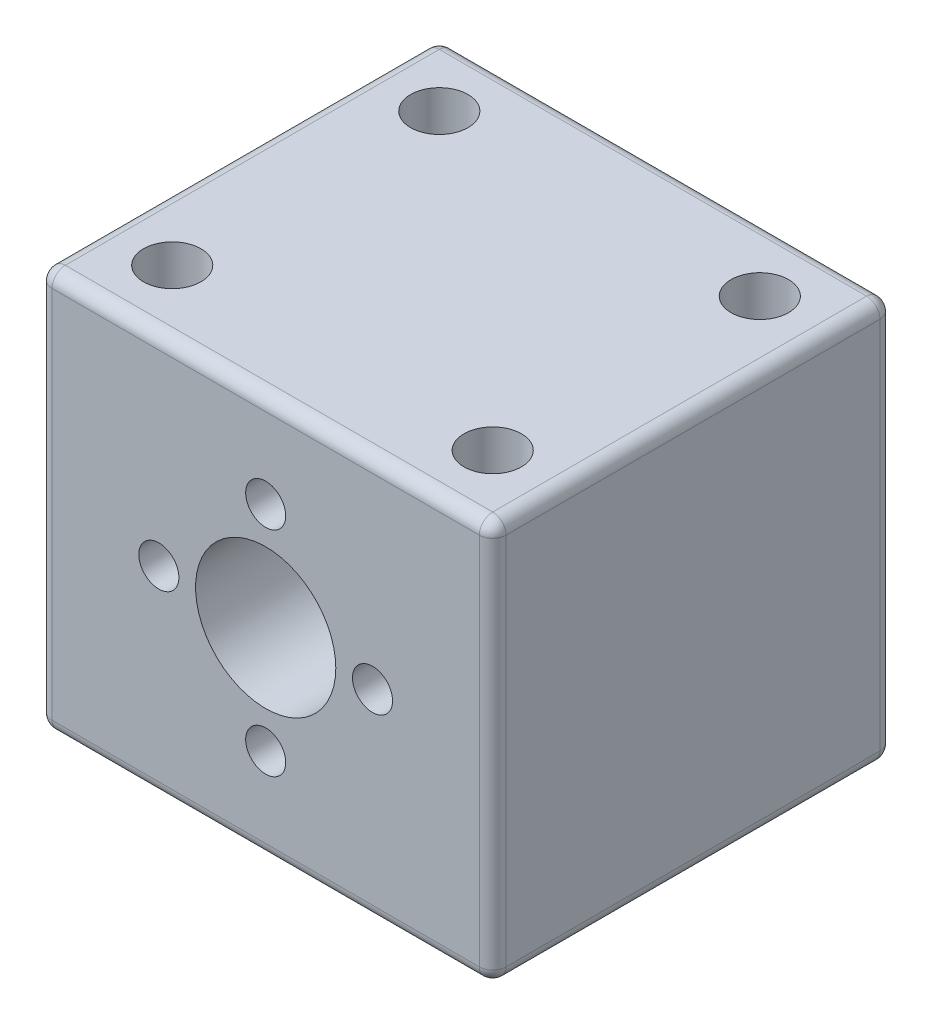
ISO-10303-21;
HEADER;
FILE_DESCRIPTION(('STEP AP214'),'2;1');
FILE_NAME('part.step','',(''),(''),'','','');
FILE_SCHEMA(('AUTOMOTIVE_DESIGN { 1 0 10303 214 1 1 1 1 }'));
ENDSEC;
DATA;
#1=APPLICATION_CONTEXT('core data for automotive mechanical design processes');
#2=APPLICATION_PROTOCOL_DEFINITION('international standard','automotive_design',2000,#1);
#3=PRODUCT_CONTEXT('',#1,'mechanical');
#4=PRODUCT('Part','Part','',(#3));
#5=PRODUCT_RELATED_PRODUCT_CATEGORY('part','',(#4));
#6=PRODUCT_DEFINITION_FORMATION('','',#4);
#7=PRODUCT_DEFINITION_CONTEXT('part definition',#1,'design');
#8=PRODUCT_DEFINITION('design','',#6,#7);
#9=PRODUCT_DEFINITION_SHAPE('','',#8);
#10=(LENGTH_UNIT() NAMED_UNIT(*) SI_UNIT(.MILLI.,.METRE.));
#11=(NAMED_UNIT(*) PLANE_ANGLE_UNIT() SI_UNIT($,.RADIAN.));
#12=(NAMED_UNIT(*) SI_UNIT($,.STERADIAN.) SOLID_ANGLE_UNIT());
#13=UNCERTAINTY_MEASURE_WITH_UNIT(LENGTH_MEASURE(1.E-05),#10,'distance_accuracy_value','');
#14=(GEOMETRIC_REPRESENTATION_CONTEXT(3) GLOBAL_UNCERTAINTY_ASSIGNED_CONTEXT((#13)) GLOBAL_UNIT_ASSIGNED_CONTEXT((#10,
#11,#12)) REPRESENTATION_CONTEXT('',''));
#15=CARTESIAN_POINT('',(0.,0.,0.));
#16=DIRECTION('',(0.,0.,1.));
#17=DIRECTION('',(1.,0.,0.));
#18=AXIS2_PLACEMENT_3D('',#15,#16,#17);
#19=CARTESIAN_POINT('',(0.,0.,30.));
#20=DIRECTION('',(1.,0.,0.));
#21=DIRECTION('',(0.,0.,-1.));
#22=AXIS2_PLACEMENT_3D('',#19,#20,#21);
#23=PLANE('',#22);
#24=DIRECTION('',(0.,-1.,0.));
#25=VECTOR('',#24,1.);
#26=CARTESIAN_POINT('',(0.,0.,1.));
#27=LINE('',#26,#25);
#28=CARTESIAN_POINT('',(0.,-1.,1.));
#29=VERTEX_POINT('',#28);
#30=CARTESIAN_POINT('',(0.,-29.,1.));
#31=VERTEX_POINT('',#30);
#32=EDGE_CURVE('E134',#29,#31,#27,.T.);
#33=ORIENTED_EDGE('',*,*,#32,.T.);
#34=DIRECTION('',(0.,0.,-1.));
#35=VECTOR('',#34,1.);
#36=CARTESIAN_POINT('',(0.,-29.,30.));
#37=LINE('',#36,#35);
#38=CARTESIAN_POINT('',(0.,-29.,29.));
#39=VERTEX_POINT('',#38);
#40=EDGE_CURVE('E132',#31,#39,#37,.F.);
#41=ORIENTED_EDGE('',*,*,#40,.T.);
#42=DIRECTION('',(0.,-1.,0.));
#43=VECTOR('',#42,1.);
#44=CARTESIAN_POINT('',(0.,0.,29.));
#45=LINE('',#44,#43);
#46=CARTESIAN_POINT('',(0.,-1.,29.));
#47=VERTEX_POINT('',#46);
#48=EDGE_CURVE('E125',#39,#47,#45,.F.);
#49=ORIENTED_EDGE('',*,*,#48,.T.);
#50=DIRECTION('',(0.,0.,-1.));
#51=VECTOR('',#50,1.);
#52=CARTESIAN_POINT('',(0.,-1.,30.));
#53=LINE('',#52,#51);
#54=EDGE_CURVE('E129',#47,#29,#53,.T.);
#55=ORIENTED_EDGE('',*,*,#54,.T.);
#56=EDGE_LOOP('',(#33,#41,#49,#55));
#57=FACE_BOUND('',#56,.T.);
#58=ADVANCED_FACE('F34',(#57),#23,.F.);
#59=CARTESIAN_POINT('',(0.,-30.,30.));
#60=DIRECTION('',(0.,1.,0.));
#61=DIRECTION('',(0.,0.,1.));
#62=AXIS2_PLACEMENT_3D('',#59,#60,#61);
#63=PLANE('',#62);
#64=DIRECTION('',(1.,0.,0.));
#65=VECTOR('',#64,1.);
#66=CARTESIAN_POINT('',(0.,-30.,1.));
#67=LINE('',#66,#65);
#68=CARTESIAN_POINT('',(1.,-30.,1.));
#69=VERTEX_POINT('',#68);
#70=CARTESIAN_POINT('',(33.,-30.,1.));
#71=VERTEX_POINT('',#70);
#72=EDGE_CURVE('E180',#69,#71,#67,.T.);
#73=ORIENTED_EDGE('',*,*,#72,.T.);
#74=DIRECTION('',(0.,0.,-1.));
#75=VECTOR('',#74,1.);
#76=CARTESIAN_POINT('',(33.,-30.,30.));
#77=LINE('',#76,#75);
#78=CARTESIAN_POINT('',(33.,-30.,29.));
#79=VERTEX_POINT('',#78);
#80=EDGE_CURVE('E183',#71,#79,#77,.F.);
#81=ORIENTED_EDGE('',*,*,#80,.T.);
#82=DIRECTION('',(1.,0.,0.));
#83=VECTOR('',#82,1.);
#84=CARTESIAN_POINT('',(0.,-30.,29.));
#85=LINE('',#84,#83);
#86=CARTESIAN_POINT('',(1.,-30.,29.));
#87=VERTEX_POINT('',#86);
#88=EDGE_CURVE('E178',#79,#87,#85,.F.);
#89=ORIENTED_EDGE('',*,*,#88,.T.);
#90=DIRECTION('',(0.,0.,-1.));
#91=VECTOR('',#90,1.);
#92=CARTESIAN_POINT('',(1.,-30.,30.));
#93=LINE('',#92,#91);
#94=EDGE_CURVE('E176',#87,#69,#93,.T.);
#95=ORIENTED_EDGE('',*,*,#94,.T.);
#96=EDGE_LOOP('',(#73,#81,#89,#95));
#97=FACE_BOUND('',#96,.T.);
#98=ADVANCED_FACE('F364',(#97),#63,.F.);
#99=CARTESIAN_POINT('',(34.,0.,30.));
#100=DIRECTION('',(-1.,0.,0.));
#101=DIRECTION('',(0.,-1.,0.));
#102=AXIS2_PLACEMENT_3D('',#99,#100,#101);
#103=PLANE('',#102);
#104=DIRECTION('',(0.,1.,0.));
#105=VECTOR('',#104,1.);
#106=CARTESIAN_POINT('',(34.,0.,1.));
#107=LINE('',#106,#105);
#108=CARTESIAN_POINT('',(34.,-29.,1.));
#109=VERTEX_POINT('',#108);
#110=CARTESIAN_POINT('',(34.,-1.,1.));
#111=VERTEX_POINT('',#110);
#112=EDGE_CURVE('E189',#109,#111,#107,.T.);
#113=ORIENTED_EDGE('',*,*,#112,.T.);
#114=DIRECTION('',(0.,0.,-1.));
#115=VECTOR('',#114,1.);
#116=CARTESIAN_POINT('',(34.,-1.,30.));
#117=LINE('',#116,#115);
#118=CARTESIAN_POINT('',(34.,-1.,29.));
#119=VERTEX_POINT('',#118);
#120=EDGE_CURVE('E192',#111,#119,#117,.F.);
#121=ORIENTED_EDGE('',*,*,#120,.T.);
#122=DIRECTION('',(0.,1.,0.));
#123=VECTOR('',#122,1.);
#124=CARTESIAN_POINT('',(34.,-30.,29.));
#125=LINE('',#124,#123);
#126=CARTESIAN_POINT('',(34.,-29.,29.));
#127=VERTEX_POINT('',#126);
#128=EDGE_CURVE('E187',#119,#127,#125,.F.);
#129=ORIENTED_EDGE('',*,*,#128,.T.);
#130=DIRECTION('',(0.,0.,-1.));
#131=VECTOR('',#130,1.);
#132=CARTESIAN_POINT('',(34.,-29.,30.));
#133=LINE('',#132,#131);
#134=EDGE_CURVE('E185',#127,#109,#133,.T.);
#135=ORIENTED_EDGE('',*,*,#134,.T.);
#136=EDGE_LOOP('',(#113,#121,#129,#135));
#137=FACE_BOUND('',#136,.T.);
#138=ADVANCED_FACE('F329',(#137),#103,.F.);
#139=CARTESIAN_POINT('',(0.,0.,30.));
#140=DIRECTION('',(0.,-1.,0.));
#141=DIRECTION('',(0.,0.,-1.));
#142=AXIS2_PLACEMENT_3D('',#139,#140,#141);
#143=PLANE('',#142);
#144=CARTESIAN_POINT('',(5.,0.,25.));
#145=DIRECTION('',(0.,1.,0.));
#146=DIRECTION('',(0.,0.,-1.));
#147=AXIS2_PLACEMENT_3D('',#144,#145,#146);
#148=CIRCLE('',#147,2.15);
#149=CARTESIAN_POINT('',(5.,0.,22.85));
#150=VERTEX_POINT('',#149);
#151=EDGE_CURVE('E298',#150,#150,#148,.T.);
#152=ORIENTED_EDGE('',*,*,#151,.F.);
#153=EDGE_LOOP('',(#152));
#154=FACE_BOUND('',#153,.T.);
#155=CARTESIAN_POINT('',(29.,0.,25.));
#156=DIRECTION('',(0.,1.,0.));
#157=DIRECTION('',(0.,0.,1.));
#158=AXIS2_PLACEMENT_3D('',#155,#156,#157);
#159=CIRCLE('',#158,2.15);
#160=CARTESIAN_POINT('',(29.,0.,27.15));
#161=VERTEX_POINT('',#160);
#162=EDGE_CURVE('E304',#161,#161,#159,.T.);
#163=ORIENTED_EDGE('',*,*,#162,.F.);
#164=EDGE_LOOP('',(#163));
#165=FACE_BOUND('',#164,.T.);
#166=CARTESIAN_POINT('',(29.,0.,4.99999999999999));
#167=DIRECTION('',(0.,1.,0.));
#168=DIRECTION('',(0.,0.,-1.));
#169=AXIS2_PLACEMENT_3D('',#166,#167,#168);
#170=CIRCLE('',#169,2.15);
#171=CARTESIAN_POINT('',(29.,0.,2.85));
#172=VERTEX_POINT('',#171);
#173=EDGE_CURVE('E310',#172,#172,#170,.T.);
#174=ORIENTED_EDGE('',*,*,#173,.F.);
#175=EDGE_LOOP('',(#174));
#176=FACE_BOUND('',#175,.T.);
#177=CARTESIAN_POINT('',(5.,0.,5.));
#178=DIRECTION('',(0.,1.,0.));
#179=DIRECTION('',(0.,0.,1.));
#180=AXIS2_PLACEMENT_3D('',#177,#178,#179);
#181=CIRCLE('',#180,2.15);
#182=CARTESIAN_POINT('',(5.,0.,7.15));
#183=VERTEX_POINT('',#182);
#184=EDGE_CURVE('E292',#183,#183,#181,.T.);
#185=ORIENTED_EDGE('',*,*,#184,.F.);
#186=EDGE_LOOP('',(#185));
#187=FACE_BOUND('',#186,.T.);
#188=DIRECTION('',(0.,0.,-1.));
#189=VECTOR('',#188,1.);
#190=CARTESIAN_POINT('',(33.,0.,30.));
#191=LINE('',#190,#189);
#192=CARTESIAN_POINT('',(33.,0.,29.));
#193=VERTEX_POINT('',#192);
#194=CARTESIAN_POINT('',(33.,0.,1.));
#195=VERTEX_POINT('',#194);
#196=EDGE_CURVE('E198',#193,#195,#191,.T.);
#197=ORIENTED_EDGE('',*,*,#196,.T.);
#198=DIRECTION('',(-1.,0.,0.));
#199=VECTOR('',#198,1.);
#200=CARTESIAN_POINT('',(0.,0.,1.));
#201=LINE('',#200,#199);
#202=CARTESIAN_POINT('',(1.,0.,1.));
#203=VERTEX_POINT('',#202);
#204=EDGE_CURVE('E200',#195,#203,#201,.T.);
#205=ORIENTED_EDGE('',*,*,#204,.T.);
#206=DIRECTION('',(0.,0.,-1.));
#207=VECTOR('',#206,1.);
#208=CARTESIAN_POINT('',(1.,0.,30.));
#209=LINE('',#208,#207);
#210=CARTESIAN_POINT('',(1.,0.,29.));
#211=VERTEX_POINT('',#210);
#212=EDGE_CURVE('E196',#203,#211,#209,.F.);
#213=ORIENTED_EDGE('',*,*,#212,.T.);
#214=DIRECTION('',(-1.,0.,0.));
#215=VECTOR('',#214,1.);
#216=CARTESIAN_POINT('',(34.,0.,29.));
#217=LINE('',#216,#215);
#218=EDGE_CURVE('E194',#211,#193,#217,.F.);
#219=ORIENTED_EDGE('',*,*,#218,.T.);
#220=EDGE_LOOP('',(#197,#205,#213,#219));
#221=FACE_BOUND('',#220,.T.);
#222=ADVANCED_FACE('F325',(#154,#165,#176,#187,#221),#143,.F.);
#223=CARTESIAN_POINT('',(0.,0.,30.));
#224=DIRECTION('',(0.,0.,1.));
#225=DIRECTION('',(1.,0.,0.));
#226=AXIS2_PLACEMENT_3D('',#223,#224,#225);
#227=PLANE('',#226);
#228=DIRECTION('',(-1.,0.,0.));
#229=VECTOR('',#228,1.);
#230=CARTESIAN_POINT('',(0.,-1.,30.));
#231=LINE('',#230,#229);
#232=CARTESIAN_POINT('',(33.,-1.,30.));
#233=VERTEX_POINT('',#232);
#234=CARTESIAN_POINT('',(1.,-1.,30.));
#235=VERTEX_POINT('',#234);
#236=EDGE_CURVE('E203',#233,#235,#231,.T.);
#237=ORIENTED_EDGE('',*,*,#236,.T.);
#238=DIRECTION('',(0.,-1.,0.));
#239=VECTOR('',#238,1.);
#240=CARTESIAN_POINT('',(1.,-30.,30.));
#241=LINE('',#240,#239);
#242=CARTESIAN_POINT('',(1.,-29.,30.));
#243=VERTEX_POINT('',#242);
#244=EDGE_CURVE('E11',#235,#243,#241,.T.);
#245=ORIENTED_EDGE('',*,*,#244,.T.);
#246=DIRECTION('',(1.,0.,0.));
#247=VECTOR('',#246,1.);
#248=CARTESIAN_POINT('',(34.,-29.,30.));
#249=LINE('',#248,#247);
#250=CARTESIAN_POINT('',(33.,-29.,30.));
#251=VERTEX_POINT('',#250);
#252=EDGE_CURVE('E43',#243,#251,#249,.T.);
#253=ORIENTED_EDGE('',*,*,#252,.T.);
#254=DIRECTION('',(0.,1.,0.));
#255=VECTOR('',#254,1.);
#256=CARTESIAN_POINT('',(33.,0.,30.));
#257=LINE('',#256,#255);
#258=EDGE_CURVE('E205',#251,#233,#257,.T.);
#259=ORIENTED_EDGE('',*,*,#258,.T.);
#260=EDGE_LOOP('',(#237,#245,#253,#259));
#261=FACE_BOUND('',#260,.T.);
#262=CARTESIAN_POINT('',(25.,-15.,30.));
#263=DIRECTION('',(0.,0.,1.));
#264=DIRECTION('',(1.,0.,0.));
#265=AXIS2_PLACEMENT_3D('',#262,#263,#264);
#266=CIRCLE('',#265,1.5);
#267=CARTESIAN_POINT('',(26.5,-15.,30.));
#268=VERTEX_POINT('',#267);
#269=EDGE_CURVE('E286',#268,#268,#266,.T.);
#270=ORIENTED_EDGE('',*,*,#269,.F.);
#271=EDGE_LOOP('',(#270));
#272=FACE_BOUND('',#271,.T.);
#273=CARTESIAN_POINT('',(17.,-7.,30.));
#274=DIRECTION('',(0.,0.,1.));
#275=DIRECTION('',(1.,0.,0.));
#276=AXIS2_PLACEMENT_3D('',#273,#274,#275);
#277=CIRCLE('',#276,1.5);
#278=CARTESIAN_POINT('',(18.5,-7.,30.));
#279=VERTEX_POINT('',#278);
#280=EDGE_CURVE('E280',#279,#279,#277,.T.);
#281=ORIENTED_EDGE('',*,*,#280,.F.);
#282=EDGE_LOOP('',(#281));
#283=FACE_BOUND('',#282,.T.);
#284=CARTESIAN_POINT('',(9.,-15.,30.));
#285=DIRECTION('',(0.,0.,1.));
#286=DIRECTION('',(1.,0.,0.));
#287=AXIS2_PLACEMENT_3D('',#284,#285,#286);
#288=CIRCLE('',#287,1.5);
#289=CARTESIAN_POINT('',(10.5,-15.,30.));
#290=VERTEX_POINT('',#289);
#291=EDGE_CURVE('E272',#290,#290,#288,.T.);
#292=ORIENTED_EDGE('',*,*,#291,.F.);
#293=EDGE_LOOP('',(#292));
#294=FACE_BOUND('',#293,.T.);
#295=CARTESIAN_POINT('',(17.,-23.,30.));
#296=DIRECTION('',(0.,0.,1.));
#297=DIRECTION('',(1.,0.,0.));
#298=AXIS2_PLACEMENT_3D('',#295,#296,#297);
#299=CIRCLE('',#298,1.5);
#300=CARTESIAN_POINT('',(18.5,-23.,30.));
#301=VERTEX_POINT('',#300);
#302=EDGE_CURVE('E261',#301,#301,#299,.T.);
#303=ORIENTED_EDGE('',*,*,#302,.F.);
#304=EDGE_LOOP('',(#303));
#305=FACE_BOUND('',#304,.T.);
#306=CARTESIAN_POINT('',(17.,-15.,30.));
#307=DIRECTION('',(0.,0.,1.));
#308=DIRECTION('',(1.,0.,0.));
#309=AXIS2_PLACEMENT_3D('',#306,#307,#308);
#310=CIRCLE('',#309,5.25);
#311=CARTESIAN_POINT('',(22.25,-15.,30.));
#312=VERTEX_POINT('',#311);
#313=EDGE_CURVE('E161',#312,#312,#310,.T.);
#314=ORIENTED_EDGE('',*,*,#313,.F.);
#315=EDGE_LOOP('',(#314));
#316=FACE_BOUND('',#315,.T.);
#317=ADVANCED_FACE('F328',(#261,#272,#283,#294,#305,#316),#227,.T.);
#318=CARTESIAN_POINT('',(0.,0.,0.));
#319=DIRECTION('',(0.,0.,1.));
#320=DIRECTION('',(1.,0.,0.));
#321=AXIS2_PLACEMENT_3D('',#318,#319,#320);
#322=PLANE('',#321);
#323=DIRECTION('',(1.,0.,0.));
#324=VECTOR('',#323,1.);
#325=CARTESIAN_POINT('',(0.,-29.,0.));
#326=LINE('',#325,#324);
#327=CARTESIAN_POINT('',(33.,-29.,0.));
#328=VERTEX_POINT('',#327);
#329=CARTESIAN_POINT('',(1.,-29.,0.));
#330=VERTEX_POINT('',#329);
#331=EDGE_CURVE('E171',#328,#330,#326,.F.);
#332=ORIENTED_EDGE('',*,*,#331,.T.);
#333=DIRECTION('',(0.,-1.,0.));
#334=VECTOR('',#333,1.);
#335=CARTESIAN_POINT('',(1.,0.,0.));
#336=LINE('',#335,#334);
#337=CARTESIAN_POINT('',(1.,-1.,0.));
#338=VERTEX_POINT('',#337);
#339=EDGE_CURVE('E173',#330,#338,#336,.F.);
#340=ORIENTED_EDGE('',*,*,#339,.T.);
#341=DIRECTION('',(-1.,0.,0.));
#342=VECTOR('',#341,1.);
#343=CARTESIAN_POINT('',(0.,-1.,0.));
#344=LINE('',#343,#342);
#345=CARTESIAN_POINT('',(33.,-1.,0.));
#346=VERTEX_POINT('',#345);
#347=EDGE_CURVE('E167',#338,#346,#344,.F.);
#348=ORIENTED_EDGE('',*,*,#347,.T.);
#349=DIRECTION('',(0.,1.,0.));
#350=VECTOR('',#349,1.);
#351=CARTESIAN_POINT('',(33.,0.,0.));
#352=LINE('',#351,#350);
#353=EDGE_CURVE('E169',#346,#328,#352,.F.);
#354=ORIENTED_EDGE('',*,*,#353,.T.);
#355=EDGE_LOOP('',(#332,#340,#348,#354));
#356=FACE_BOUND('',#355,.T.);
#357=CARTESIAN_POINT('',(17.,-15.,0.));
#358=DIRECTION('',(0.,0.,1.));
#359=DIRECTION('',(1.,0.,0.));
#360=AXIS2_PLACEMENT_3D('',#357,#358,#359);
#361=CIRCLE('',#360,5.25);
#362=CARTESIAN_POINT('',(22.25,-15.,0.));
#363=VERTEX_POINT('',#362);
#364=EDGE_CURVE('E158',#363,#363,#361,.T.);
#365=ORIENTED_EDGE('',*,*,#364,.T.);
#366=EDGE_LOOP('',(#365));
#367=FACE_BOUND('',#366,.T.);
#368=ADVANCED_FACE('F694',(#356,#367),#322,.F.);
#369=CARTESIAN_POINT('',(17.,-15.,0.));
#370=DIRECTION('',(0.,0.,1.));
#371=DIRECTION('',(1.,0.,0.));
#372=AXIS2_PLACEMENT_3D('',#369,#370,#371);
#373=CYLINDRICAL_SURFACE('',#372,5.25);
#374=ORIENTED_EDGE('',*,*,#364,.F.);
#375=EDGE_LOOP('',(#374));
#376=FACE_BOUND('',#375,.T.);
#377=ORIENTED_EDGE('',*,*,#313,.T.);
#378=EDGE_LOOP('',(#377));
#379=FACE_BOUND('',#378,.T.);
#380=ADVANCED_FACE('F685',(#376,#379),#373,.F.);
#381=CARTESIAN_POINT('',(17.,-23.,15.));
#382=DIRECTION('',(0.,0.,1.));
#383=DIRECTION('',(1.,0.,0.));
#384=AXIS2_PLACEMENT_3D('',#381,#382,#383);
#385=CYLINDRICAL_SURFACE('',#384,1.5);
#386=CARTESIAN_POINT('',(17.,-23.,15.));
#387=DIRECTION('',(0.,0.,1.));
#388=DIRECTION('',(1.,0.,0.));
#389=AXIS2_PLACEMENT_3D('',#386,#387,#388);
#390=CIRCLE('',#389,1.5);
#391=CARTESIAN_POINT('',(18.5,-23.,15.));
#392=VERTEX_POINT('',#391);
#393=EDGE_CURVE('E267',#392,#392,#390,.T.);
#394=ORIENTED_EDGE('',*,*,#393,.F.);
#395=EDGE_LOOP('',(#394));
#396=FACE_BOUND('',#395,.T.);
#397=ORIENTED_EDGE('',*,*,#302,.T.);
#398=EDGE_LOOP('',(#397));
#399=FACE_BOUND('',#398,.T.);
#400=ADVANCED_FACE('F676',(#396,#399),#385,.F.);
#401=CARTESIAN_POINT('',(17.,-23.,15.));
#402=DIRECTION('',(0.,0.,1.));
#403=DIRECTION('',(1.,0.,0.));
#404=AXIS2_PLACEMENT_3D('',#401,#402,#403);
#405=PLANE('',#404);
#406=ORIENTED_EDGE('',*,*,#393,.T.);
#407=EDGE_LOOP('',(#406));
#408=FACE_BOUND('',#407,.T.);
#409=ADVANCED_FACE('F667',(#408),#405,.T.);
#410=CARTESIAN_POINT('',(9.,-15.,15.));
#411=DIRECTION('',(0.,0.,1.));
#412=DIRECTION('',(1.,0.,0.));
#413=AXIS2_PLACEMENT_3D('',#410,#411,#412);
#414=CYLINDRICAL_SURFACE('',#413,1.5);
#415=CARTESIAN_POINT('',(9.,-15.,15.));
#416=DIRECTION('',(0.,0.,1.));
#417=DIRECTION('',(1.,0.,0.));
#418=AXIS2_PLACEMENT_3D('',#415,#416,#417);
#419=CIRCLE('',#418,1.5);
#420=CARTESIAN_POINT('',(10.5,-15.,15.));
#421=VERTEX_POINT('',#420);
#422=EDGE_CURVE('E277',#421,#421,#419,.T.);
#423=ORIENTED_EDGE('',*,*,#422,.F.);
#424=EDGE_LOOP('',(#423));
#425=FACE_BOUND('',#424,.T.);
#426=ORIENTED_EDGE('',*,*,#291,.T.);
#427=EDGE_LOOP('',(#426));
#428=FACE_BOUND('',#427,.T.);
#429=ADVANCED_FACE('F658',(#425,#428),#414,.F.);
#430=CARTESIAN_POINT('',(9.,-15.,15.));
#431=DIRECTION('',(0.,0.,1.));
#432=DIRECTION('',(1.,0.,0.));
#433=AXIS2_PLACEMENT_3D('',#430,#431,#432);
#434=PLANE('',#433);
#435=ORIENTED_EDGE('',*,*,#422,.T.);
#436=EDGE_LOOP('',(#435));
#437=FACE_BOUND('',#436,.T.);
#438=ADVANCED_FACE('F649',(#437),#434,.T.);
#439=CARTESIAN_POINT('',(17.,-7.,15.));
#440=DIRECTION('',(0.,0.,1.));
#441=DIRECTION('',(1.,0.,0.));
#442=AXIS2_PLACEMENT_3D('',#439,#440,#441);
#443=CYLINDRICAL_SURFACE('',#442,1.5);
#444=CARTESIAN_POINT('',(17.,-7.,15.));
#445=DIRECTION('',(0.,0.,1.));
#446=DIRECTION('',(1.,0.,0.));
#447=AXIS2_PLACEMENT_3D('',#444,#445,#446);
#448=CIRCLE('',#447,1.5);
#449=CARTESIAN_POINT('',(18.5,-7.,15.));
#450=VERTEX_POINT('',#449);
#451=EDGE_CURVE('E283',#450,#450,#448,.T.);
#452=ORIENTED_EDGE('',*,*,#451,.F.);
#453=EDGE_LOOP('',(#452));
#454=FACE_BOUND('',#453,.T.);
#455=ORIENTED_EDGE('',*,*,#280,.T.);
#456=EDGE_LOOP('',(#455));
#457=FACE_BOUND('',#456,.T.);
#458=ADVANCED_FACE('F640',(#454,#457),#443,.F.);
#459=CARTESIAN_POINT('',(17.,-7.,15.));
#460=DIRECTION('',(0.,0.,1.));
#461=DIRECTION('',(1.,0.,0.));
#462=AXIS2_PLACEMENT_3D('',#459,#460,#461);
#463=PLANE('',#462);
#464=ORIENTED_EDGE('',*,*,#451,.T.);
#465=EDGE_LOOP('',(#464));
#466=FACE_BOUND('',#465,.T.);
#467=ADVANCED_FACE('F631',(#466),#463,.T.);
#468=CARTESIAN_POINT('',(25.,-15.,15.));
#469=DIRECTION('',(0.,0.,1.));
#470=DIRECTION('',(1.,0.,0.));
#471=AXIS2_PLACEMENT_3D('',#468,#469,#470);
#472=CYLINDRICAL_SURFACE('',#471,1.5);
#473=CARTESIAN_POINT('',(25.,-15.,15.));
#474=DIRECTION('',(0.,0.,1.));
#475=DIRECTION('',(1.,0.,0.));
#476=AXIS2_PLACEMENT_3D('',#473,#474,#475);
#477=CIRCLE('',#476,1.5);
#478=CARTESIAN_POINT('',(26.5,-15.,15.));
#479=VERTEX_POINT('',#478);
#480=EDGE_CURVE('E289',#479,#479,#477,.T.);
#481=ORIENTED_EDGE('',*,*,#480,.F.);
#482=EDGE_LOOP('',(#481));
#483=FACE_BOUND('',#482,.T.);
#484=ORIENTED_EDGE('',*,*,#269,.T.);
#485=EDGE_LOOP('',(#484));
#486=FACE_BOUND('',#485,.T.);
#487=ADVANCED_FACE('F622',(#483,#486),#472,.F.);
#488=CARTESIAN_POINT('',(25.,-15.,15.));
#489=DIRECTION('',(0.,0.,1.));
#490=DIRECTION('',(1.,0.,0.));
#491=AXIS2_PLACEMENT_3D('',#488,#489,#490);
#492=PLANE('',#491);
#493=ORIENTED_EDGE('',*,*,#480,.T.);
#494=EDGE_LOOP('',(#493));
#495=FACE_BOUND('',#494,.T.);
#496=ADVANCED_FACE('F361',(#495),#492,.T.);
#497=CARTESIAN_POINT('',(33.,0.,29.));
#498=DIRECTION('',(0.,-1.,0.));
#499=DIRECTION('',(1.,0.,0.));
#500=AXIS2_PLACEMENT_3D('',#497,#498,#499);
#501=CYLINDRICAL_SURFACE('',#500,1.);
#502=CARTESIAN_POINT('',(33.,-1.,29.));
#503=DIRECTION('',(0.,1.,0.));
#504=DIRECTION('',(-1.,0.,0.));
#505=AXIS2_PLACEMENT_3D('',#502,#503,#504);
#506=CIRCLE('',#505,1.);
#507=EDGE_CURVE('E38',#233,#119,#506,.T.);
#508=ORIENTED_EDGE('',*,*,#507,.F.);
#509=ORIENTED_EDGE('',*,*,#258,.F.);
#510=CARTESIAN_POINT('',(33.,-29.,29.));
#511=DIRECTION('',(0.,-1.,0.));
#512=DIRECTION('',(0.,0.,-1.));
#513=AXIS2_PLACEMENT_3D('',#510,#511,#512);
#514=CIRCLE('',#513,1.);
#515=EDGE_CURVE('E254',#127,#251,#514,.T.);
#516=ORIENTED_EDGE('',*,*,#515,.F.);
#517=ORIENTED_EDGE('',*,*,#128,.F.);
#518=EDGE_LOOP('',(#508,#509,#516,#517));
#519=FACE_BOUND('',#518,.T.);
#520=ADVANCED_FACE('F36',(#519),#501,.T.);
#521=CARTESIAN_POINT('',(33.,-1.,29.));
#522=DIRECTION('',(1.,0.,0.));
#523=DIRECTION('',(0.,1.,0.));
#524=AXIS2_PLACEMENT_3D('',#521,#522,#523);
#525=SPHERICAL_SURFACE('',#524,1.);
#526=CARTESIAN_POINT('',(33.,-1.,29.));
#527=DIRECTION('',(1.,0.,0.));
#528=DIRECTION('',(0.,0.,-1.));
#529=AXIS2_PLACEMENT_3D('',#526,#527,#528);
#530=CIRCLE('',#529,1.);
#531=EDGE_CURVE('E249',#233,#193,#530,.F.);
#532=ORIENTED_EDGE('',*,*,#531,.F.);
#533=ORIENTED_EDGE('',*,*,#507,.T.);
#534=CARTESIAN_POINT('',(33.,-1.,29.));
#535=DIRECTION('',(0.,0.,1.));
#536=DIRECTION('',(1.,0.,0.));
#537=AXIS2_PLACEMENT_3D('',#534,#535,#536);
#538=CIRCLE('',#537,1.);
#539=EDGE_CURVE('E252',#193,#119,#538,.F.);
#540=ORIENTED_EDGE('',*,*,#539,.F.);
#541=EDGE_LOOP('',(#532,#533,#540));
#542=FACE_BOUND('',#541,.T.);
#543=ADVANCED_FACE('F353',(#542),#525,.T.);
#544=CARTESIAN_POINT('',(33.,-29.,29.));
#545=DIRECTION('',(0.,0.,1.));
#546=DIRECTION('',(1.,0.,0.));
#547=AXIS2_PLACEMENT_3D('',#544,#545,#546);
#548=SPHERICAL_SURFACE('',#547,1.);
#549=CARTESIAN_POINT('',(33.,-29.,29.));
#550=DIRECTION('',(0.,0.,1.));
#551=DIRECTION('',(1.,0.,0.));
#552=AXIS2_PLACEMENT_3D('',#549,#550,#551);
#553=CIRCLE('',#552,1.);
#554=EDGE_CURVE('E243',#127,#79,#553,.F.);
#555=ORIENTED_EDGE('',*,*,#554,.F.);
#556=ORIENTED_EDGE('',*,*,#515,.T.);
#557=CARTESIAN_POINT('',(33.,-29.,29.));
#558=DIRECTION('',(1.,0.,0.));
#559=DIRECTION('',(0.,0.,-1.));
#560=AXIS2_PLACEMENT_3D('',#557,#558,#559);
#561=CIRCLE('',#560,1.);
#562=EDGE_CURVE('E246',#79,#251,#561,.F.);
#563=ORIENTED_EDGE('',*,*,#562,.F.);
#564=EDGE_LOOP('',(#555,#556,#563));
#565=FACE_BOUND('',#564,.T.);
#566=ADVANCED_FACE('F355',(#565),#548,.T.);
#567=CARTESIAN_POINT('',(33.,-1.,30.));
#568=DIRECTION('',(0.,0.,-1.));
#569=DIRECTION('',(-1.,0.,0.));
#570=AXIS2_PLACEMENT_3D('',#567,#568,#569);
#571=CYLINDRICAL_SURFACE('',#570,1.);
#572=ORIENTED_EDGE('',*,*,#539,.T.);
#573=ORIENTED_EDGE('',*,*,#120,.F.);
#574=CARTESIAN_POINT('',(33.,-1.,1.));
#575=DIRECTION('',(0.,0.,-1.));
#576=DIRECTION('',(-1.,0.,0.));
#577=AXIS2_PLACEMENT_3D('',#574,#575,#576);
#578=CIRCLE('',#577,1.);
#579=EDGE_CURVE('E238',#195,#111,#578,.T.);
#580=ORIENTED_EDGE('',*,*,#579,.F.);
#581=ORIENTED_EDGE('',*,*,#196,.F.);
#582=EDGE_LOOP('',(#572,#573,#580,#581));
#583=FACE_BOUND('',#582,.T.);
#584=ADVANCED_FACE('F341',(#583),#571,.T.);
#585=CARTESIAN_POINT('',(0.,-1.,29.));
#586=DIRECTION('',(1.,0.,0.));
#587=DIRECTION('',(0.,0.,-1.));
#588=AXIS2_PLACEMENT_3D('',#585,#586,#587);
#589=CYLINDRICAL_SURFACE('',#588,1.);
#590=ORIENTED_EDGE('',*,*,#531,.T.);
#591=ORIENTED_EDGE('',*,*,#218,.F.);
#592=CARTESIAN_POINT('',(1.,-1.,29.));
#593=DIRECTION('',(-1.,0.,0.));
#594=DIRECTION('',(0.,0.,1.));
#595=AXIS2_PLACEMENT_3D('',#592,#593,#594);
#596=CIRCLE('',#595,1.);
#597=EDGE_CURVE('E144',#235,#211,#596,.T.);
#598=ORIENTED_EDGE('',*,*,#597,.F.);
#599=ORIENTED_EDGE('',*,*,#236,.F.);
#600=EDGE_LOOP('',(#590,#591,#598,#599));
#601=FACE_BOUND('',#600,.T.);
#602=ADVANCED_FACE('F351',(#601),#589,.T.);
#603=CARTESIAN_POINT('',(1.,0.,29.));
#604=DIRECTION('',(0.,1.,0.));
#605=DIRECTION('',(0.,0.,1.));
#606=AXIS2_PLACEMENT_3D('',#603,#604,#605);
#607=CYLINDRICAL_SURFACE('',#606,1.);
#608=CARTESIAN_POINT('',(1.,-29.,29.));
#609=DIRECTION('',(0.,-1.,0.));
#610=DIRECTION('',(0.,0.,-1.));
#611=AXIS2_PLACEMENT_3D('',#608,#609,#610);
#612=CIRCLE('',#611,1.);
#613=EDGE_CURVE('E145',#243,#39,#612,.T.);
#614=ORIENTED_EDGE('',*,*,#613,.F.);
#615=ORIENTED_EDGE('',*,*,#244,.F.);
#616=CARTESIAN_POINT('',(1.,-1.,29.));
#617=DIRECTION('',(0.,1.,0.));
#618=DIRECTION('',(0.,0.,1.));
#619=AXIS2_PLACEMENT_3D('',#616,#617,#618);
#620=CIRCLE('',#619,1.);
#621=EDGE_CURVE('E138',#47,#235,#620,.T.);
#622=ORIENTED_EDGE('',*,*,#621,.F.);
#623=ORIENTED_EDGE('',*,*,#48,.F.);
#624=EDGE_LOOP('',(#614,#615,#622,#623));
#625=FACE_BOUND('',#624,.T.);
#626=ADVANCED_FACE('F140',(#625),#607,.T.);
#627=CARTESIAN_POINT('',(0.,-29.,29.));
#628=DIRECTION('',(-1.,0.,0.));
#629=DIRECTION('',(0.,0.,1.));
#630=AXIS2_PLACEMENT_3D('',#627,#628,#629);
#631=CYLINDRICAL_SURFACE('',#630,1.);
#632=ORIENTED_EDGE('',*,*,#562,.T.);
#633=ORIENTED_EDGE('',*,*,#252,.F.);
#634=CARTESIAN_POINT('',(1.,-29.,29.));
#635=DIRECTION('',(-1.,0.,0.));
#636=DIRECTION('',(0.,0.,1.));
#637=AXIS2_PLACEMENT_3D('',#634,#635,#636);
#638=CIRCLE('',#637,1.);
#639=EDGE_CURVE('E51',#87,#243,#638,.T.);
#640=ORIENTED_EDGE('',*,*,#639,.F.);
#641=ORIENTED_EDGE('',*,*,#88,.F.);
#642=EDGE_LOOP('',(#632,#633,#640,#641));
#643=FACE_BOUND('',#642,.T.);
#644=ADVANCED_FACE('F415',(#643),#631,.T.);
#645=CARTESIAN_POINT('',(33.,-29.,30.));
#646=DIRECTION('',(0.,0.,-1.));
#647=DIRECTION('',(-1.,0.,0.));
#648=AXIS2_PLACEMENT_3D('',#645,#646,#647);
#649=CYLINDRICAL_SURFACE('',#648,1.);
#650=ORIENTED_EDGE('',*,*,#554,.T.);
#651=ORIENTED_EDGE('',*,*,#80,.F.);
#652=CARTESIAN_POINT('',(33.,-29.,1.));
#653=DIRECTION('',(0.,0.,-1.));
#654=DIRECTION('',(-1.,0.,0.));
#655=AXIS2_PLACEMENT_3D('',#652,#653,#654);
#656=CIRCLE('',#655,1.);
#657=EDGE_CURVE('E232',#109,#71,#656,.T.);
#658=ORIENTED_EDGE('',*,*,#657,.F.);
#659=ORIENTED_EDGE('',*,*,#134,.F.);
#660=EDGE_LOOP('',(#650,#651,#658,#659));
#661=FACE_BOUND('',#660,.T.);
#662=ADVANCED_FACE('F411',(#661),#649,.T.);
#663=CARTESIAN_POINT('',(33.,0.,1.));
#664=DIRECTION('',(0.,1.,0.));
#665=DIRECTION('',(-1.,0.,0.));
#666=AXIS2_PLACEMENT_3D('',#663,#664,#665);
#667=CYLINDRICAL_SURFACE('',#666,1.);
#668=CARTESIAN_POINT('',(33.,-1.,1.));
#669=DIRECTION('',(0.,1.,0.));
#670=DIRECTION('',(-1.,0.,0.));
#671=AXIS2_PLACEMENT_3D('',#668,#669,#670);
#672=CIRCLE('',#671,1.);
#673=EDGE_CURVE('E240',#111,#346,#672,.T.);
#674=ORIENTED_EDGE('',*,*,#673,.F.);
#675=ORIENTED_EDGE('',*,*,#112,.F.);
#676=CARTESIAN_POINT('',(33.,-29.,1.));
#677=DIRECTION('',(0.,-1.,0.));
#678=DIRECTION('',(0.,0.,-1.));
#679=AXIS2_PLACEMENT_3D('',#676,#677,#678);
#680=CIRCLE('',#679,1.);
#681=EDGE_CURVE('E229',#328,#109,#680,.T.);
#682=ORIENTED_EDGE('',*,*,#681,.F.);
#683=ORIENTED_EDGE('',*,*,#353,.F.);
#684=EDGE_LOOP('',(#674,#675,#682,#683));
#685=FACE_BOUND('',#684,.T.);
#686=ADVANCED_FACE('F408',(#685),#667,.T.);
#687=CARTESIAN_POINT('',(33.,-1.,1.));
#688=DIRECTION('',(1.,0.,0.));
#689=DIRECTION('',(0.,0.,-1.));
#690=AXIS2_PLACEMENT_3D('',#687,#688,#689);
#691=SPHERICAL_SURFACE('',#690,1.);
#692=ORIENTED_EDGE('',*,*,#579,.T.);
#693=ORIENTED_EDGE('',*,*,#673,.T.);
#694=CARTESIAN_POINT('',(33.,-1.,1.));
#695=DIRECTION('',(1.,0.,0.));
#696=DIRECTION('',(0.,0.,-1.));
#697=AXIS2_PLACEMENT_3D('',#694,#695,#696);
#698=CIRCLE('',#697,1.);
#699=EDGE_CURVE('E152',#195,#346,#698,.F.);
#700=ORIENTED_EDGE('',*,*,#699,.F.);
#701=EDGE_LOOP('',(#692,#693,#700));
#702=FACE_BOUND('',#701,.T.);
#703=ADVANCED_FACE('F344',(#702),#691,.T.);
#704=CARTESIAN_POINT('',(1.,-1.,29.));
#705=DIRECTION('',(0.,0.,1.));
#706=DIRECTION('',(1.,0.,0.));
#707=AXIS2_PLACEMENT_3D('',#704,#705,#706);
#708=SPHERICAL_SURFACE('',#707,1.);
#709=ORIENTED_EDGE('',*,*,#621,.T.);
#710=ORIENTED_EDGE('',*,*,#597,.T.);
#711=CARTESIAN_POINT('',(1.,-1.,29.));
#712=DIRECTION('',(0.,0.,1.));
#713=DIRECTION('',(1.,0.,0.));
#714=AXIS2_PLACEMENT_3D('',#711,#712,#713);
#715=CIRCLE('',#714,1.);
#716=EDGE_CURVE('E148',#47,#211,#715,.F.);
#717=ORIENTED_EDGE('',*,*,#716,.F.);
#718=EDGE_LOOP('',(#709,#710,#717));
#719=FACE_BOUND('',#718,.T.);
#720=ADVANCED_FACE('F149',(#719),#708,.T.);
#721=CARTESIAN_POINT('',(1.,-29.,29.));
#722=DIRECTION('',(0.,0.,1.));
#723=DIRECTION('',(1.,0.,0.));
#724=AXIS2_PLACEMENT_3D('',#721,#722,#723);
#725=SPHERICAL_SURFACE('',#724,1.);
#726=ORIENTED_EDGE('',*,*,#639,.T.);
#727=ORIENTED_EDGE('',*,*,#613,.T.);
#728=CARTESIAN_POINT('',(1.,-29.,29.));
#729=DIRECTION('',(0.,0.,1.));
#730=DIRECTION('',(1.,0.,0.));
#731=AXIS2_PLACEMENT_3D('',#728,#729,#730);
#732=CIRCLE('',#731,1.);
#733=EDGE_CURVE('E153',#87,#39,#732,.F.);
#734=ORIENTED_EDGE('',*,*,#733,.F.);
#735=EDGE_LOOP('',(#726,#727,#734));
#736=FACE_BOUND('',#735,.T.);
#737=ADVANCED_FACE('F400',(#736),#725,.T.);
#738=CARTESIAN_POINT('',(33.,-29.,1.));
#739=DIRECTION('',(1.,0.,0.));
#740=DIRECTION('',(0.,0.,-1.));
#741=AXIS2_PLACEMENT_3D('',#738,#739,#740);
#742=SPHERICAL_SURFACE('',#741,1.);
#743=ORIENTED_EDGE('',*,*,#681,.T.);
#744=ORIENTED_EDGE('',*,*,#657,.T.);
#745=CARTESIAN_POINT('',(33.,-29.,1.));
#746=DIRECTION('',(1.,0.,0.));
#747=DIRECTION('',(0.,0.,-1.));
#748=AXIS2_PLACEMENT_3D('',#745,#746,#747);
#749=CIRCLE('',#748,1.);
#750=EDGE_CURVE('E223',#328,#71,#749,.F.);
#751=ORIENTED_EDGE('',*,*,#750,.F.);
#752=EDGE_LOOP('',(#743,#744,#751));
#753=FACE_BOUND('',#752,.T.);
#754=ADVANCED_FACE('F397',(#753),#742,.T.);
#755=CARTESIAN_POINT('',(0.,-1.,1.));
#756=DIRECTION('',(-1.,0.,0.));
#757=DIRECTION('',(0.,0.,1.));
#758=AXIS2_PLACEMENT_3D('',#755,#756,#757);
#759=CYLINDRICAL_SURFACE('',#758,1.);
#760=ORIENTED_EDGE('',*,*,#699,.T.);
#761=ORIENTED_EDGE('',*,*,#347,.F.);
#762=CARTESIAN_POINT('',(1.,-1.,1.));
#763=DIRECTION('',(-1.,0.,0.));
#764=DIRECTION('',(0.,0.,1.));
#765=AXIS2_PLACEMENT_3D('',#762,#763,#764);
#766=CIRCLE('',#765,1.);
#767=EDGE_CURVE('E220',#203,#338,#766,.T.);
#768=ORIENTED_EDGE('',*,*,#767,.F.);
#769=ORIENTED_EDGE('',*,*,#204,.F.);
#770=EDGE_LOOP('',(#760,#761,#768,#769));
#771=FACE_BOUND('',#770,.T.);
#772=ADVANCED_FACE('F348',(#771),#759,.T.);
#773=CARTESIAN_POINT('',(1.,-1.,30.));
#774=DIRECTION('',(0.,0.,-1.));
#775=DIRECTION('',(-1.,0.,0.));
#776=AXIS2_PLACEMENT_3D('',#773,#774,#775);
#777=CYLINDRICAL_SURFACE('',#776,1.);
#778=ORIENTED_EDGE('',*,*,#716,.T.);
#779=ORIENTED_EDGE('',*,*,#212,.F.);
#780=CARTESIAN_POINT('',(1.,-1.,1.));
#781=DIRECTION('',(0.,0.,-1.));
#782=DIRECTION('',(-1.,0.,0.));
#783=AXIS2_PLACEMENT_3D('',#780,#781,#782);
#784=CIRCLE('',#783,1.);
#785=EDGE_CURVE('E156',#29,#203,#784,.T.);
#786=ORIENTED_EDGE('',*,*,#785,.F.);
#787=ORIENTED_EDGE('',*,*,#54,.F.);
#788=EDGE_LOOP('',(#778,#779,#786,#787));
#789=FACE_BOUND('',#788,.T.);
#790=ADVANCED_FACE('F155',(#789),#777,.T.);
#791=CARTESIAN_POINT('',(1.,-29.,30.));
#792=DIRECTION('',(0.,0.,-1.));
#793=DIRECTION('',(-1.,0.,0.));
#794=AXIS2_PLACEMENT_3D('',#791,#792,#793);
#795=CYLINDRICAL_SURFACE('',#794,1.);
#796=ORIENTED_EDGE('',*,*,#733,.T.);
#797=ORIENTED_EDGE('',*,*,#40,.F.);
#798=CARTESIAN_POINT('',(1.,-29.,1.));
#799=DIRECTION('',(0.,0.,-1.));
#800=DIRECTION('',(-1.,0.,0.));
#801=AXIS2_PLACEMENT_3D('',#798,#799,#800);
#802=CIRCLE('',#801,1.);
#803=EDGE_CURVE('E216',#69,#31,#802,.T.);
#804=ORIENTED_EDGE('',*,*,#803,.F.);
#805=ORIENTED_EDGE('',*,*,#94,.F.);
#806=EDGE_LOOP('',(#796,#797,#804,#805));
#807=FACE_BOUND('',#806,.T.);
#808=ADVANCED_FACE('F388',(#807),#795,.T.);
#809=CARTESIAN_POINT('',(0.,-29.,1.));
#810=DIRECTION('',(1.,0.,0.));
#811=DIRECTION('',(0.,0.,-1.));
#812=AXIS2_PLACEMENT_3D('',#809,#810,#811);
#813=CYLINDRICAL_SURFACE('',#812,1.);
#814=ORIENTED_EDGE('',*,*,#750,.T.);
#815=ORIENTED_EDGE('',*,*,#72,.F.);
#816=CARTESIAN_POINT('',(1.,-29.,1.));
#817=DIRECTION('',(-1.,0.,0.));
#818=DIRECTION('',(0.,0.,1.));
#819=AXIS2_PLACEMENT_3D('',#816,#817,#818);
#820=CIRCLE('',#819,1.);
#821=EDGE_CURVE('E213',#330,#69,#820,.T.);
#822=ORIENTED_EDGE('',*,*,#821,.F.);
#823=ORIENTED_EDGE('',*,*,#331,.F.);
#824=EDGE_LOOP('',(#814,#815,#822,#823));
#825=FACE_BOUND('',#824,.T.);
#826=ADVANCED_FACE('F385',(#825),#813,.T.);
#827=CARTESIAN_POINT('',(1.,-1.,1.));
#828=DIRECTION('',(0.,1.,0.));
#829=DIRECTION('',(0.,0.,1.));
#830=AXIS2_PLACEMENT_3D('',#827,#828,#829);
#831=SPHERICAL_SURFACE('',#830,1.);
#832=ORIENTED_EDGE('',*,*,#785,.T.);
#833=ORIENTED_EDGE('',*,*,#767,.T.);
#834=CARTESIAN_POINT('',(1.,-1.,1.));
#835=DIRECTION('',(0.,1.,0.));
#836=DIRECTION('',(0.,0.,1.));
#837=AXIS2_PLACEMENT_3D('',#834,#835,#836);
#838=CIRCLE('',#837,1.);
#839=EDGE_CURVE('E210',#29,#338,#838,.F.);
#840=ORIENTED_EDGE('',*,*,#839,.F.);
#841=EDGE_LOOP('',(#832,#833,#840));
#842=FACE_BOUND('',#841,.T.);
#843=ADVANCED_FACE('F381',(#842),#831,.T.);
#844=CARTESIAN_POINT('',(1.,-29.,1.));
#845=DIRECTION('',(0.,-1.,0.));
#846=DIRECTION('',(0.,0.,-1.));
#847=AXIS2_PLACEMENT_3D('',#844,#845,#846);
#848=SPHERICAL_SURFACE('',#847,1.);
#849=ORIENTED_EDGE('',*,*,#821,.T.);
#850=ORIENTED_EDGE('',*,*,#803,.T.);
#851=CARTESIAN_POINT('',(1.,-29.,1.));
#852=DIRECTION('',(0.,-1.,0.));
#853=DIRECTION('',(0.,0.,-1.));
#854=AXIS2_PLACEMENT_3D('',#851,#852,#853);
#855=CIRCLE('',#854,1.);
#856=EDGE_CURVE('E208',#330,#31,#855,.F.);
#857=ORIENTED_EDGE('',*,*,#856,.F.);
#858=EDGE_LOOP('',(#849,#850,#857));
#859=FACE_BOUND('',#858,.T.);
#860=ADVANCED_FACE('F377',(#859),#848,.T.);
#861=CARTESIAN_POINT('',(1.,0.,1.));
#862=DIRECTION('',(0.,-1.,0.));
#863=DIRECTION('',(0.,0.,-1.));
#864=AXIS2_PLACEMENT_3D('',#861,#862,#863);
#865=CYLINDRICAL_SURFACE('',#864,1.);
#866=ORIENTED_EDGE('',*,*,#839,.T.);
#867=ORIENTED_EDGE('',*,*,#339,.F.);
#868=ORIENTED_EDGE('',*,*,#856,.T.);
#869=ORIENTED_EDGE('',*,*,#32,.F.);
#870=EDGE_LOOP('',(#866,#867,#868,#869));
#871=FACE_BOUND('',#870,.T.);
#872=ADVANCED_FACE('F373',(#871),#865,.T.);
#873=CARTESIAN_POINT('',(5.,-20.,5.));
#874=DIRECTION('',(0.,1.,0.));
#875=DIRECTION('',(0.,0.,1.));
#876=AXIS2_PLACEMENT_3D('',#873,#874,#875);
#877=CYLINDRICAL_SURFACE('',#876,2.15);
#878=CARTESIAN_POINT('',(5.,-20.,5.));
#879=DIRECTION('',(0.,1.,0.));
#880=DIRECTION('',(0.,0.,1.));
#881=AXIS2_PLACEMENT_3D('',#878,#879,#880);
#882=CIRCLE('',#881,2.15);
#883=CARTESIAN_POINT('',(5.,-20.,7.15));
#884=VERTEX_POINT('',#883);
#885=EDGE_CURVE('E211',#884,#884,#882,.T.);
#886=ORIENTED_EDGE('',*,*,#885,.F.);
#887=EDGE_LOOP('',(#886));
#888=FACE_BOUND('',#887,.T.);
#889=ORIENTED_EDGE('',*,*,#184,.T.);
#890=EDGE_LOOP('',(#889));
#891=FACE_BOUND('',#890,.T.);
#892=ADVANCED_FACE('F376',(#888,#891),#877,.F.);
#893=CARTESIAN_POINT('',(5.,-20.,5.));
#894=DIRECTION('',(0.,1.,0.));
#895=DIRECTION('',(0.,0.,1.));
#896=AXIS2_PLACEMENT_3D('',#893,#894,#895);
#897=PLANE('',#896);
#898=ORIENTED_EDGE('',*,*,#885,.T.);
#899=EDGE_LOOP('',(#898));
#900=FACE_BOUND('',#899,.T.);
#901=ADVANCED_FACE('F321',(#900),#897,.T.);
#902=CARTESIAN_POINT('',(29.,-20.,4.99999999999999));
#903=DIRECTION('',(0.,1.,0.));
#904=DIRECTION('',(0.,0.,1.));
#905=AXIS2_PLACEMENT_3D('',#902,#903,#904);
#906=CYLINDRICAL_SURFACE('',#905,2.15);
#907=CARTESIAN_POINT('',(29.,-20.,4.99999999999999));
#908=DIRECTION('',(0.,1.,0.));
#909=DIRECTION('',(0.,0.,-1.));
#910=AXIS2_PLACEMENT_3D('',#907,#908,#909);
#911=CIRCLE('',#910,2.15);
#912=CARTESIAN_POINT('',(29.,-20.,2.85));
#913=VERTEX_POINT('',#912);
#914=EDGE_CURVE('E295',#913,#913,#911,.T.);
#915=ORIENTED_EDGE('',*,*,#914,.F.);
#916=EDGE_LOOP('',(#915));
#917=FACE_BOUND('',#916,.T.);
#918=ORIENTED_EDGE('',*,*,#173,.T.);
#919=EDGE_LOOP('',(#918));
#920=FACE_BOUND('',#919,.T.);
#921=ADVANCED_FACE('F318',(#917,#920),#906,.F.);
#922=CARTESIAN_POINT('',(29.,-20.,4.99999999999999));
#923=DIRECTION('',(0.,-1.,0.));
#924=DIRECTION('',(0.,0.,-1.));
#925=AXIS2_PLACEMENT_3D('',#922,#923,#924);
#926=PLANE('',#925);
#927=ORIENTED_EDGE('',*,*,#914,.T.);
#928=EDGE_LOOP('',(#927));
#929=FACE_BOUND('',#928,.T.);
#930=ADVANCED_FACE('F316',(#929),#926,.F.);
#931=CARTESIAN_POINT('',(29.,-20.,25.));
#932=DIRECTION('',(0.,1.,0.));
#933=DIRECTION('',(0.,0.,1.));
#934=AXIS2_PLACEMENT_3D('',#931,#932,#933);
#935=CYLINDRICAL_SURFACE('',#934,2.15);
#936=CARTESIAN_POINT('',(29.,-20.,25.));
#937=DIRECTION('',(0.,1.,0.));
#938=DIRECTION('',(0.,0.,1.));
#939=AXIS2_PLACEMENT_3D('',#936,#937,#938);
#940=CIRCLE('',#939,2.15);
#941=CARTESIAN_POINT('',(29.,-20.,27.15));
#942=VERTEX_POINT('',#941);
#943=EDGE_CURVE('E307',#942,#942,#940,.T.);
#944=ORIENTED_EDGE('',*,*,#943,.F.);
#945=EDGE_LOOP('',(#944));
#946=FACE_BOUND('',#945,.T.);
#947=ORIENTED_EDGE('',*,*,#162,.T.);
#948=EDGE_LOOP('',(#947));
#949=FACE_BOUND('',#948,.T.);
#950=ADVANCED_FACE('F518',(#946,#949),#935,.F.);
#951=CARTESIAN_POINT('',(29.,-20.,25.));
#952=DIRECTION('',(0.,1.,0.));
#953=DIRECTION('',(0.,0.,1.));
#954=AXIS2_PLACEMENT_3D('',#951,#952,#953);
#955=PLANE('',#954);
#956=ORIENTED_EDGE('',*,*,#943,.T.);
#957=EDGE_LOOP('',(#956));
#958=FACE_BOUND('',#957,.T.);
#959=ADVANCED_FACE('F525',(#958),#955,.T.);
#960=CARTESIAN_POINT('',(5.,-20.,25.));
#961=DIRECTION('',(0.,1.,0.));
#962=DIRECTION('',(0.,0.,1.));
#963=AXIS2_PLACEMENT_3D('',#960,#961,#962);
#964=CYLINDRICAL_SURFACE('',#963,2.15);
#965=CARTESIAN_POINT('',(5.,-20.,25.));
#966=DIRECTION('',(0.,1.,0.));
#967=DIRECTION('',(0.,0.,-1.));
#968=AXIS2_PLACEMENT_3D('',#965,#966,#967);
#969=CIRCLE('',#968,2.15);
#970=CARTESIAN_POINT('',(5.,-20.,22.85));
#971=VERTEX_POINT('',#970);
#972=EDGE_CURVE('E301',#971,#971,#969,.T.);
#973=ORIENTED_EDGE('',*,*,#972,.F.);
#974=EDGE_LOOP('',(#973));
#975=FACE_BOUND('',#974,.T.);
#976=ORIENTED_EDGE('',*,*,#151,.T.);
#977=EDGE_LOOP('',(#976));
#978=FACE_BOUND('',#977,.T.);
#979=ADVANCED_FACE('F533',(#975,#978),#964,.F.);
#980=CARTESIAN_POINT('',(5.,-20.,25.));
#981=DIRECTION('',(0.,-1.,0.));
#982=DIRECTION('',(0.,0.,-1.));
#983=AXIS2_PLACEMENT_3D('',#980,#981,#982);
#984=PLANE('',#983);
#985=ORIENTED_EDGE('',*,*,#972,.T.);
#986=EDGE_LOOP('',(#985));
#987=FACE_BOUND('',#986,.T.);
#988=ADVANCED_FACE('F541',(#987),#984,.F.);
#989=CLOSED_SHELL('',(#58,#98,#138,#222,#317,#368,#380,#400,#409,#429,#438,#458,#467,#487,#496,
#520,#543,#566,#584,#602,#626,#644,#662,#686,#703,#720,#737,#754,#772,#790,#808,#826,#843,#860,
#872,#892,#901,#921,#930,#950,#959,#979,#988));
#990=MANIFOLD_SOLID_BREP('B2',#989);
#991=ADVANCED_BREP_SHAPE_REPRESENTATION('',(#18,#990),#14);
#992=SHAPE_DEFINITION_REPRESENTATION(#9,#991);
ENDSEC;
END-ISO-10303-21;
